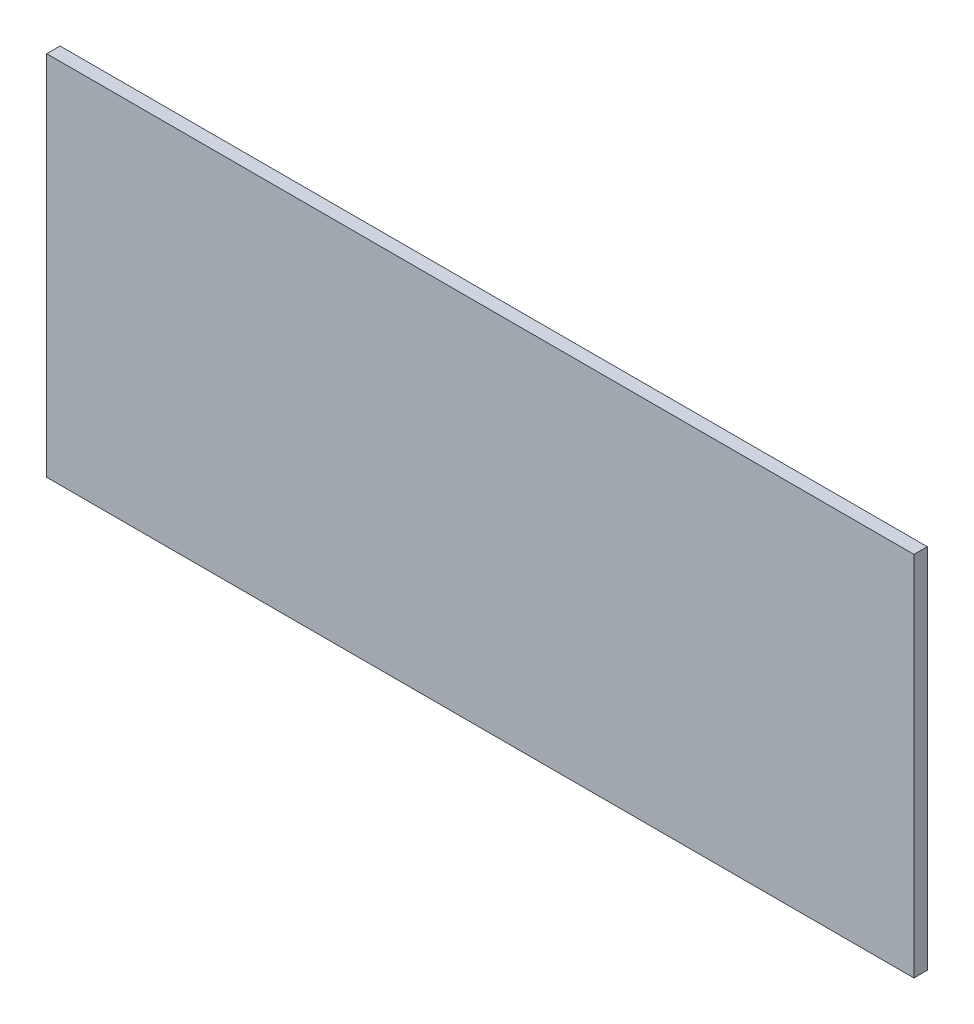
ISO-10303-21;
HEADER;
FILE_DESCRIPTION(('STEP AP214'),'2;1');
FILE_NAME('part.step','',(''),(''),'','','');
FILE_SCHEMA(('AUTOMOTIVE_DESIGN { 1 0 10303 214 1 1 1 1 }'));
ENDSEC;
DATA;
#1=APPLICATION_CONTEXT('core data for automotive mechanical design processes');
#2=APPLICATION_PROTOCOL_DEFINITION('international standard','automotive_design',2000,#1);
#3=PRODUCT_CONTEXT('',#1,'mechanical');
#4=PRODUCT('Part','Part','',(#3));
#5=PRODUCT_RELATED_PRODUCT_CATEGORY('part','',(#4));
#6=PRODUCT_DEFINITION_FORMATION('','',#4);
#7=PRODUCT_DEFINITION_CONTEXT('part definition',#1,'design');
#8=PRODUCT_DEFINITION('design','',#6,#7);
#9=PRODUCT_DEFINITION_SHAPE('','',#8);
#10=(LENGTH_UNIT() NAMED_UNIT(*) SI_UNIT(.MILLI.,.METRE.));
#11=(NAMED_UNIT(*) PLANE_ANGLE_UNIT() SI_UNIT($,.RADIAN.));
#12=(NAMED_UNIT(*) SI_UNIT($,.STERADIAN.) SOLID_ANGLE_UNIT());
#13=UNCERTAINTY_MEASURE_WITH_UNIT(LENGTH_MEASURE(1.E-05),#10,'distance_accuracy_value','');
#14=(GEOMETRIC_REPRESENTATION_CONTEXT(3) GLOBAL_UNCERTAINTY_ASSIGNED_CONTEXT((#13)) GLOBAL_UNIT_ASSIGNED_CONTEXT((#10,
#11,#12)) REPRESENTATION_CONTEXT('',''));
#15=CARTESIAN_POINT('',(0.,0.,0.));
#16=DIRECTION('',(0.,0.,1.));
#17=DIRECTION('',(1.,0.,0.));
#18=AXIS2_PLACEMENT_3D('',#15,#16,#17);
#19=CARTESIAN_POINT('',(-64.9999999999997,-27.4999999999967,1.99999999999972));
#20=DIRECTION('',(-0.999999999999992,0.,0.));
#21=DIRECTION('',(0.,0.,0.999999999999991));
#22=AXIS2_PLACEMENT_3D('',#19,#20,#21);
#23=PLANE('',#22);
#24=DIRECTION('',(0.,1.,0.));
#25=VECTOR('',#24,1.);
#26=CARTESIAN_POINT('',(-64.9999999999995,-27.4999999999967,-1.11022302462516E-13));
#27=LINE('',#26,#25);
#28=CARTESIAN_POINT('',(-64.9999999999995,-27.4999999999967,-1.11022302462516E-13));
#29=VERTEX_POINT('',#28);
#30=CARTESIAN_POINT('',(-65.0000000000001,27.500000000003,-1.66533453693773E-13));
#31=VERTEX_POINT('',#30);
#32=EDGE_CURVE('E95',#29,#31,#27,.T.);
#33=ORIENTED_EDGE('',*,*,#32,.F.);
#34=DIRECTION('',(0.,0.,-0.999999999999991));
#35=VECTOR('',#34,1.);
#36=CARTESIAN_POINT('',(-64.9999999999997,-27.4999999999967,1.99999999999972));
#37=LINE('',#36,#35);
#38=CARTESIAN_POINT('',(-64.9999999999997,-27.4999999999967,1.99999999999972));
#39=VERTEX_POINT('',#38);
#40=EDGE_CURVE('E11',#39,#29,#37,.T.);
#41=ORIENTED_EDGE('',*,*,#40,.F.);
#42=DIRECTION('',(0.,1.,0.));
#43=VECTOR('',#42,1.);
#44=CARTESIAN_POINT('',(-64.9999999999997,-27.4999999999967,1.99999999999972));
#45=LINE('',#44,#43);
#46=CARTESIAN_POINT('',(-64.9999999999995,27.500000000003,2.00000000000017));
#47=VERTEX_POINT('',#46);
#48=EDGE_CURVE('E90',#39,#47,#45,.T.);
#49=ORIENTED_EDGE('',*,*,#48,.T.);
#50=DIRECTION('',(0.,0.,-0.999999999999991));
#51=VECTOR('',#50,1.);
#52=CARTESIAN_POINT('',(-64.9999999999995,27.500000000003,2.00000000000017));
#53=LINE('',#52,#51);
#54=EDGE_CURVE('E33',#47,#31,#53,.T.);
#55=ORIENTED_EDGE('',*,*,#54,.T.);
#56=EDGE_LOOP('',(#33,#41,#49,#55));
#57=FACE_BOUND('',#56,.T.);
#58=ADVANCED_FACE('F30',(#57),#23,.T.);
#59=CARTESIAN_POINT('',(-64.9999999999997,-27.4999999999967,1.99999999999972));
#60=DIRECTION('',(0.,1.,0.));
#61=DIRECTION('',(0.,0.,0.999999999999991));
#62=AXIS2_PLACEMENT_3D('',#59,#60,#61);
#63=PLANE('',#62);
#64=DIRECTION('',(0.999999999999992,0.,0.));
#65=VECTOR('',#64,1.);
#66=CARTESIAN_POINT('',(-64.9999999999995,-27.4999999999967,-1.11022302462516E-13));
#67=LINE('',#66,#65);
#68=CARTESIAN_POINT('',(64.9999999999996,-27.4999999999996,-2.22044604925031E-13));
#69=VERTEX_POINT('',#68);
#70=EDGE_CURVE('E63',#29,#69,#67,.T.);
#71=ORIENTED_EDGE('',*,*,#70,.T.);
#72=DIRECTION('',(0.,0.,-0.999999999999991));
#73=VECTOR('',#72,1.);
#74=CARTESIAN_POINT('',(64.9999999999992,-27.5000000000001,2.00000000000006));
#75=LINE('',#74,#73);
#76=CARTESIAN_POINT('',(64.9999999999992,-27.5000000000001,2.00000000000006));
#77=VERTEX_POINT('',#76);
#78=EDGE_CURVE('E39',#77,#69,#75,.T.);
#79=ORIENTED_EDGE('',*,*,#78,.F.);
#80=DIRECTION('',(0.999999999999992,0.,0.));
#81=VECTOR('',#80,1.);
#82=CARTESIAN_POINT('',(-64.9999999999997,-27.4999999999967,1.99999999999972));
#83=LINE('',#82,#81);
#84=EDGE_CURVE('E80',#39,#77,#83,.T.);
#85=ORIENTED_EDGE('',*,*,#84,.F.);
#86=ORIENTED_EDGE('',*,*,#40,.T.);
#87=EDGE_LOOP('',(#71,#79,#85,#86));
#88=FACE_BOUND('',#87,.T.);
#89=ADVANCED_FACE('F105',(#88),#63,.F.);
#90=CARTESIAN_POINT('',(64.9999999999992,-27.5000000000001,2.00000000000006));
#91=DIRECTION('',(-0.999999999999992,0.,0.));
#92=DIRECTION('',(0.,0.,0.999999999999991));
#93=AXIS2_PLACEMENT_3D('',#90,#91,#92);
#94=PLANE('',#93);
#95=DIRECTION('',(0.,1.,0.));
#96=VECTOR('',#95,1.);
#97=CARTESIAN_POINT('',(64.9999999999996,-27.4999999999996,-2.22044604925031E-13));
#98=LINE('',#97,#96);
#99=CARTESIAN_POINT('',(64.9999999999993,27.5000000000003,-6.66133814775094E-13));
#100=VERTEX_POINT('',#99);
#101=EDGE_CURVE('E87',#69,#100,#98,.T.);
#102=ORIENTED_EDGE('',*,*,#101,.T.);
#103=DIRECTION('',(0.,0.,-0.999999999999991));
#104=VECTOR('',#103,1.);
#105=CARTESIAN_POINT('',(64.9999999999996,27.4999999999999,1.99999999999995));
#106=LINE('',#105,#104);
#107=CARTESIAN_POINT('',(64.9999999999996,27.4999999999999,1.99999999999995));
#108=VERTEX_POINT('',#107);
#109=EDGE_CURVE('E84',#108,#100,#106,.T.);
#110=ORIENTED_EDGE('',*,*,#109,.F.);
#111=DIRECTION('',(0.,1.,0.));
#112=VECTOR('',#111,1.);
#113=CARTESIAN_POINT('',(64.9999999999992,-27.5000000000001,2.00000000000006));
#114=LINE('',#113,#112);
#115=EDGE_CURVE('E75',#77,#108,#114,.T.);
#116=ORIENTED_EDGE('',*,*,#115,.F.);
#117=ORIENTED_EDGE('',*,*,#78,.T.);
#118=EDGE_LOOP('',(#102,#110,#116,#117));
#119=FACE_BOUND('',#118,.T.);
#120=ADVANCED_FACE('F85',(#119),#94,.F.);
#121=CARTESIAN_POINT('',(-64.9999999999995,27.500000000003,2.00000000000017));
#122=DIRECTION('',(0.,1.,0.));
#123=DIRECTION('',(0.,0.,0.999999999999991));
#124=AXIS2_PLACEMENT_3D('',#121,#122,#123);
#125=PLANE('',#124);
#126=DIRECTION('',(0.999999999999992,0.,0.));
#127=VECTOR('',#126,1.);
#128=CARTESIAN_POINT('',(-65.0000000000001,27.500000000003,-1.66533453693773E-13));
#129=LINE('',#128,#127);
#130=EDGE_CURVE('E98',#31,#100,#129,.T.);
#131=ORIENTED_EDGE('',*,*,#130,.F.);
#132=ORIENTED_EDGE('',*,*,#54,.F.);
#133=DIRECTION('',(0.999999999999992,0.,0.));
#134=VECTOR('',#133,1.);
#135=CARTESIAN_POINT('',(-64.9999999999995,27.500000000003,2.00000000000017));
#136=LINE('',#135,#134);
#137=EDGE_CURVE('E79',#47,#108,#136,.T.);
#138=ORIENTED_EDGE('',*,*,#137,.T.);
#139=ORIENTED_EDGE('',*,*,#109,.T.);
#140=EDGE_LOOP('',(#131,#132,#138,#139));
#141=FACE_BOUND('',#140,.T.);
#142=ADVANCED_FACE('F89',(#141),#125,.T.);
#143=CARTESIAN_POINT('',(1.11022302462516E-13,0.,1.99999999999967));
#144=DIRECTION('',(0.,0.,-0.999999999999991));
#145=DIRECTION('',(-0.999999999999992,0.,0.));
#146=AXIS2_PLACEMENT_3D('',#143,#144,#145);
#147=PLANE('',#146);
#148=ORIENTED_EDGE('',*,*,#48,.F.);
#149=ORIENTED_EDGE('',*,*,#84,.T.);
#150=ORIENTED_EDGE('',*,*,#115,.T.);
#151=ORIENTED_EDGE('',*,*,#137,.F.);
#152=EDGE_LOOP('',(#148,#149,#150,#151));
#153=FACE_BOUND('',#152,.T.);
#154=ADVANCED_FACE('F78',(#153),#147,.F.);
#155=CARTESIAN_POINT('',(0.,0.,0.));
#156=DIRECTION('',(0.,0.,-0.999999999999991));
#157=DIRECTION('',(-0.999999999999992,0.,0.));
#158=AXIS2_PLACEMENT_3D('',#155,#156,#157);
#159=PLANE('',#158);
#160=ORIENTED_EDGE('',*,*,#32,.T.);
#161=ORIENTED_EDGE('',*,*,#130,.T.);
#162=ORIENTED_EDGE('',*,*,#101,.F.);
#163=ORIENTED_EDGE('',*,*,#70,.F.);
#164=EDGE_LOOP('',(#160,#161,#162,#163));
#165=FACE_BOUND('',#164,.T.);
#166=ADVANCED_FACE('F103',(#165),#159,.T.);
#167=CLOSED_SHELL('',(#58,#89,#120,#142,#154,#166));
#168=MANIFOLD_SOLID_BREP('B2',#167);
#169=ADVANCED_BREP_SHAPE_REPRESENTATION('',(#18,#168),#14);
#170=SHAPE_DEFINITION_REPRESENTATION(#9,#169);
ENDSEC;
END-ISO-10303-21;
